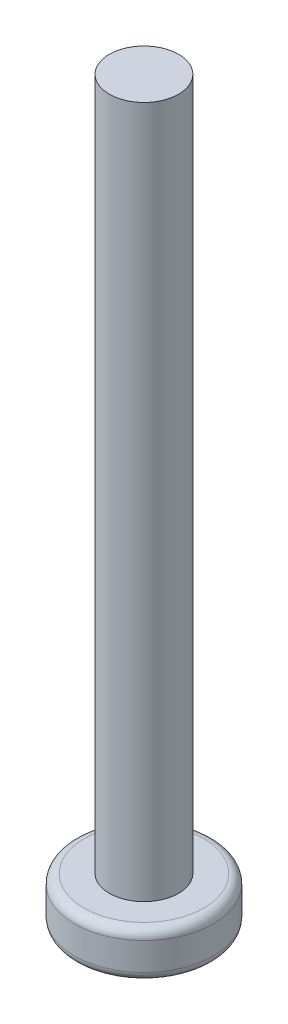
ISO-10303-21;
HEADER;
FILE_DESCRIPTION(('STEP AP214'),'2;1');
FILE_NAME('part.step','',(''),(''),'','','');
FILE_SCHEMA(('AUTOMOTIVE_DESIGN { 1 0 10303 214 1 1 1 1 }'));
ENDSEC;
DATA;
#1=APPLICATION_CONTEXT('core data for automotive mechanical design processes');
#2=APPLICATION_PROTOCOL_DEFINITION('international standard','automotive_design',2000,#1);
#3=PRODUCT_CONTEXT('',#1,'mechanical');
#4=PRODUCT('Part','Part','',(#3));
#5=PRODUCT_RELATED_PRODUCT_CATEGORY('part','',(#4));
#6=PRODUCT_DEFINITION_FORMATION('','',#4);
#7=PRODUCT_DEFINITION_CONTEXT('part definition',#1,'design');
#8=PRODUCT_DEFINITION('design','',#6,#7);
#9=PRODUCT_DEFINITION_SHAPE('','',#8);
#10=(LENGTH_UNIT() NAMED_UNIT(*) SI_UNIT(.MILLI.,.METRE.));
#11=(NAMED_UNIT(*) PLANE_ANGLE_UNIT() SI_UNIT($,.RADIAN.));
#12=(NAMED_UNIT(*) SI_UNIT($,.STERADIAN.) SOLID_ANGLE_UNIT());
#13=UNCERTAINTY_MEASURE_WITH_UNIT(LENGTH_MEASURE(1.E-05),#10,'distance_accuracy_value','');
#14=(GEOMETRIC_REPRESENTATION_CONTEXT(3) GLOBAL_UNCERTAINTY_ASSIGNED_CONTEXT((#13)) GLOBAL_UNIT_ASSIGNED_CONTEXT((#10,
#11,#12)) REPRESENTATION_CONTEXT('',''));
#15=CARTESIAN_POINT('',(0.,0.,0.));
#16=DIRECTION('',(0.,0.,1.));
#17=DIRECTION('',(1.,0.,0.));
#18=AXIS2_PLACEMENT_3D('',#15,#16,#17);
#19=CARTESIAN_POINT('',(0.,2.,0.));
#20=DIRECTION('',(0.,1.,0.));
#21=DIRECTION('',(0.,0.,1.));
#22=AXIS2_PLACEMENT_3D('',#19,#20,#21);
#23=PLANE('',#22);
#24=CARTESIAN_POINT('',(0.,2.,0.));
#25=DIRECTION('',(0.,1.,0.));
#26=DIRECTION('',(0.,0.,1.));
#27=AXIS2_PLACEMENT_3D('',#24,#25,#26);
#28=CIRCLE('',#27,2.6);
#29=CARTESIAN_POINT('',(0.,2.,2.6));
#30=VERTEX_POINT('',#29);
#31=EDGE_CURVE('E215',#30,#30,#28,.T.);
#32=ORIENTED_EDGE('',*,*,#31,.T.);
#33=EDGE_LOOP('',(#32));
#34=FACE_BOUND('',#33,.T.);
#35=CARTESIAN_POINT('',(0.,2.,0.));
#36=DIRECTION('',(0.,1.,0.));
#37=DIRECTION('',(0.,0.,1.));
#38=AXIS2_PLACEMENT_3D('',#35,#36,#37);
#39=CIRCLE('',#38,1.5);
#40=CARTESIAN_POINT('',(0.,2.,1.5));
#41=VERTEX_POINT('',#40);
#42=EDGE_CURVE('E194',#41,#41,#39,.T.);
#43=ORIENTED_EDGE('',*,*,#42,.F.);
#44=EDGE_LOOP('',(#43));
#45=FACE_BOUND('',#44,.T.);
#46=ADVANCED_FACE('F35',(#34,#45),#23,.T.);
#47=CARTESIAN_POINT('',(0.,2.,0.));
#48=DIRECTION('',(0.,-1.,0.));
#49=DIRECTION('',(0.,0.,-1.));
#50=AXIS2_PLACEMENT_3D('',#47,#48,#49);
#51=CYLINDRICAL_SURFACE('',#50,3.);
#52=CARTESIAN_POINT('',(0.,1.6,0.));
#53=DIRECTION('',(0.,1.,0.));
#54=DIRECTION('',(0.,0.,1.));
#55=AXIS2_PLACEMENT_3D('',#52,#53,#54);
#56=CIRCLE('',#55,3.);
#57=CARTESIAN_POINT('',(0.,1.6,3.));
#58=VERTEX_POINT('',#57);
#59=EDGE_CURVE('E43',#58,#58,#56,.F.);
#60=ORIENTED_EDGE('',*,*,#59,.T.);
#61=EDGE_LOOP('',(#60));
#62=FACE_BOUND('',#61,.T.);
#63=CARTESIAN_POINT('',(0.,0.4,0.));
#64=DIRECTION('',(0.,1.,0.));
#65=DIRECTION('',(0.,0.,1.));
#66=AXIS2_PLACEMENT_3D('',#63,#64,#65);
#67=CIRCLE('',#66,3.);
#68=CARTESIAN_POINT('',(0.,0.4,3.));
#69=VERTEX_POINT('',#68);
#70=EDGE_CURVE('E220',#69,#69,#67,.T.);
#71=ORIENTED_EDGE('',*,*,#70,.T.);
#72=EDGE_LOOP('',(#71));
#73=FACE_BOUND('',#72,.T.);
#74=ADVANCED_FACE('F225',(#62,#73),#51,.T.);
#75=CARTESIAN_POINT('',(0.,0.,0.));
#76=DIRECTION('',(0.,1.,0.));
#77=DIRECTION('',(0.,0.,1.));
#78=AXIS2_PLACEMENT_3D('',#75,#76,#77);
#79=PLANE('',#78);
#80=CARTESIAN_POINT('',(0.,0.,0.));
#81=DIRECTION('',(0.,1.,0.));
#82=DIRECTION('',(0.,0.,1.));
#83=AXIS2_PLACEMENT_3D('',#80,#81,#82);
#84=CIRCLE('',#83,2.6);
#85=CARTESIAN_POINT('',(0.,0.,2.6));
#86=VERTEX_POINT('',#85);
#87=EDGE_CURVE('E11',#86,#86,#84,.F.);
#88=ORIENTED_EDGE('',*,*,#87,.T.);
#89=EDGE_LOOP('',(#88));
#90=FACE_BOUND('',#89,.T.);
#91=DIRECTION('',(1.,0.,0.));
#92=VECTOR('',#91,1.);
#93=CARTESIAN_POINT('',(0.,0.,0.45));
#94=LINE('',#93,#92);
#95=CARTESIAN_POINT('',(-1.5,0.,0.45));
#96=VERTEX_POINT('',#95);
#97=CARTESIAN_POINT('',(-0.45,0.,0.45));
#98=VERTEX_POINT('',#97);
#99=EDGE_CURVE('E162',#96,#98,#94,.T.);
#100=ORIENTED_EDGE('',*,*,#99,.T.);
#101=DIRECTION('',(0.,0.,-1.));
#102=VECTOR('',#101,1.);
#103=CARTESIAN_POINT('',(-0.45,0.,0.));
#104=LINE('',#103,#102);
#105=CARTESIAN_POINT('',(-0.45,0.,1.5));
#106=VERTEX_POINT('',#105);
#107=EDGE_CURVE('E50',#106,#98,#104,.T.);
#108=ORIENTED_EDGE('',*,*,#107,.F.);
#109=DIRECTION('',(1.,0.,0.));
#110=VECTOR('',#109,1.);
#111=CARTESIAN_POINT('',(0.,0.,1.5));
#112=LINE('',#111,#110);
#113=CARTESIAN_POINT('',(0.45,0.,1.5));
#114=VERTEX_POINT('',#113);
#115=EDGE_CURVE('E189',#106,#114,#112,.T.);
#116=ORIENTED_EDGE('',*,*,#115,.T.);
#117=DIRECTION('',(0.,0.,-1.));
#118=VECTOR('',#117,1.);
#119=CARTESIAN_POINT('',(0.45,0.,0.));
#120=LINE('',#119,#118);
#121=CARTESIAN_POINT('',(0.45,0.,0.45));
#122=VERTEX_POINT('',#121);
#123=EDGE_CURVE('E187',#114,#122,#120,.T.);
#124=ORIENTED_EDGE('',*,*,#123,.T.);
#125=DIRECTION('',(1.,0.,0.));
#126=VECTOR('',#125,1.);
#127=CARTESIAN_POINT('',(0.,0.,0.45));
#128=LINE('',#127,#126);
#129=CARTESIAN_POINT('',(1.5,0.,0.45));
#130=VERTEX_POINT('',#129);
#131=EDGE_CURVE('E145',#122,#130,#128,.T.);
#132=ORIENTED_EDGE('',*,*,#131,.T.);
#133=DIRECTION('',(0.,0.,-1.));
#134=VECTOR('',#133,1.);
#135=CARTESIAN_POINT('',(1.5,0.,0.));
#136=LINE('',#135,#134);
#137=CARTESIAN_POINT('',(1.5,0.,-0.45));
#138=VERTEX_POINT('',#137);
#139=EDGE_CURVE('E183',#130,#138,#136,.T.);
#140=ORIENTED_EDGE('',*,*,#139,.T.);
#141=DIRECTION('',(1.,0.,0.));
#142=VECTOR('',#141,1.);
#143=CARTESIAN_POINT('',(0.,0.,-0.45));
#144=LINE('',#143,#142);
#145=CARTESIAN_POINT('',(0.45,0.,-0.45));
#146=VERTEX_POINT('',#145);
#147=EDGE_CURVE('E180',#146,#138,#144,.T.);
#148=ORIENTED_EDGE('',*,*,#147,.F.);
#149=DIRECTION('',(0.,0.,-1.));
#150=VECTOR('',#149,1.);
#151=CARTESIAN_POINT('',(0.45,0.,0.));
#152=LINE('',#151,#150);
#153=CARTESIAN_POINT('',(0.45,0.,-1.5));
#154=VERTEX_POINT('',#153);
#155=EDGE_CURVE('E177',#146,#154,#152,.T.);
#156=ORIENTED_EDGE('',*,*,#155,.T.);
#157=DIRECTION('',(1.,0.,0.));
#158=VECTOR('',#157,1.);
#159=CARTESIAN_POINT('',(0.,0.,-1.5));
#160=LINE('',#159,#158);
#161=CARTESIAN_POINT('',(-0.45,0.,-1.5));
#162=VERTEX_POINT('',#161);
#163=EDGE_CURVE('E174',#162,#154,#160,.T.);
#164=ORIENTED_EDGE('',*,*,#163,.F.);
#165=DIRECTION('',(0.,0.,-1.));
#166=VECTOR('',#165,1.);
#167=CARTESIAN_POINT('',(-0.45,0.,0.));
#168=LINE('',#167,#166);
#169=CARTESIAN_POINT('',(-0.45,0.,-0.45));
#170=VERTEX_POINT('',#169);
#171=EDGE_CURVE('E171',#170,#162,#168,.T.);
#172=ORIENTED_EDGE('',*,*,#171,.F.);
#173=DIRECTION('',(1.,0.,0.));
#174=VECTOR('',#173,1.);
#175=CARTESIAN_POINT('',(0.,0.,-0.45));
#176=LINE('',#175,#174);
#177=CARTESIAN_POINT('',(-1.5,0.,-0.45));
#178=VERTEX_POINT('',#177);
#179=EDGE_CURVE('E168',#178,#170,#176,.T.);
#180=ORIENTED_EDGE('',*,*,#179,.F.);
#181=DIRECTION('',(0.,0.,-1.));
#182=VECTOR('',#181,1.);
#183=CARTESIAN_POINT('',(-1.5,0.,0.));
#184=LINE('',#183,#182);
#185=EDGE_CURVE('E165',#96,#178,#184,.T.);
#186=ORIENTED_EDGE('',*,*,#185,.F.);
#187=EDGE_LOOP('',(#100,#108,#116,#124,#132,#140,#148,#156,#164,#172,#180,#186));
#188=FACE_BOUND('',#187,.T.);
#189=ADVANCED_FACE('F241',(#90,#188),#79,.F.);
#190=CARTESIAN_POINT('',(0.,32.,0.));
#191=DIRECTION('',(0.,-1.,0.));
#192=DIRECTION('',(0.,0.,-1.));
#193=AXIS2_PLACEMENT_3D('',#190,#191,#192);
#194=CYLINDRICAL_SURFACE('',#193,1.5);
#195=CARTESIAN_POINT('',(0.,32.,0.));
#196=DIRECTION('',(0.,1.,0.));
#197=DIRECTION('',(0.,0.,1.));
#198=AXIS2_PLACEMENT_3D('',#195,#196,#197);
#199=CIRCLE('',#198,1.5);
#200=CARTESIAN_POINT('',(0.,32.,1.5));
#201=VERTEX_POINT('',#200);
#202=EDGE_CURVE('E212',#201,#201,#199,.T.);
#203=ORIENTED_EDGE('',*,*,#202,.F.);
#204=EDGE_LOOP('',(#203));
#205=FACE_BOUND('',#204,.T.);
#206=ORIENTED_EDGE('',*,*,#42,.T.);
#207=EDGE_LOOP('',(#206));
#208=FACE_BOUND('',#207,.T.);
#209=ADVANCED_FACE('F238',(#205,#208),#194,.T.);
#210=CARTESIAN_POINT('',(0.,32.,0.));
#211=DIRECTION('',(0.,1.,0.));
#212=DIRECTION('',(0.,0.,1.));
#213=AXIS2_PLACEMENT_3D('',#210,#211,#212);
#214=PLANE('',#213);
#215=ORIENTED_EDGE('',*,*,#202,.T.);
#216=EDGE_LOOP('',(#215));
#217=FACE_BOUND('',#216,.T.);
#218=ADVANCED_FACE('F240',(#217),#214,.T.);
#219=CARTESIAN_POINT('',(-0.45,1.9,0.));
#220=DIRECTION('',(-1.,0.,0.));
#221=DIRECTION('',(0.,0.,1.));
#222=AXIS2_PLACEMENT_3D('',#219,#220,#221);
#223=PLANE('',#222);
#224=ORIENTED_EDGE('',*,*,#107,.T.);
#225=DIRECTION('',(0.,-1.,0.));
#226=VECTOR('',#225,1.);
#227=CARTESIAN_POINT('',(-0.45,1.9,0.45));
#228=LINE('',#227,#226);
#229=CARTESIAN_POINT('',(-0.45,1.9,0.45));
#230=VERTEX_POINT('',#229);
#231=EDGE_CURVE('E160',#230,#98,#228,.T.);
#232=ORIENTED_EDGE('',*,*,#231,.F.);
#233=DIRECTION('',(0.,0.,-1.));
#234=VECTOR('',#233,1.);
#235=CARTESIAN_POINT('',(-0.45,1.9,0.));
#236=LINE('',#235,#234);
#237=CARTESIAN_POINT('',(-0.45,1.9,1.5));
#238=VERTEX_POINT('',#237);
#239=EDGE_CURVE('E192',#238,#230,#236,.T.);
#240=ORIENTED_EDGE('',*,*,#239,.F.);
#241=DIRECTION('',(0.,-1.,0.));
#242=VECTOR('',#241,1.);
#243=CARTESIAN_POINT('',(-0.45,1.9,1.5));
#244=LINE('',#243,#242);
#245=EDGE_CURVE('E58',#238,#106,#244,.T.);
#246=ORIENTED_EDGE('',*,*,#245,.T.);
#247=EDGE_LOOP('',(#224,#232,#240,#246));
#248=FACE_BOUND('',#247,.T.);
#249=ADVANCED_FACE('F248',(#248),#223,.F.);
#250=CARTESIAN_POINT('',(0.,1.9,1.5));
#251=DIRECTION('',(0.,0.,-1.));
#252=DIRECTION('',(-1.,0.,0.));
#253=AXIS2_PLACEMENT_3D('',#250,#251,#252);
#254=PLANE('',#253);
#255=ORIENTED_EDGE('',*,*,#115,.F.);
#256=ORIENTED_EDGE('',*,*,#245,.F.);
#257=DIRECTION('',(1.,0.,0.));
#258=VECTOR('',#257,1.);
#259=CARTESIAN_POINT('',(0.,1.9,1.5));
#260=LINE('',#259,#258);
#261=CARTESIAN_POINT('',(0.45,1.9,1.5));
#262=VERTEX_POINT('',#261);
#263=EDGE_CURVE('E138',#238,#262,#260,.T.);
#264=ORIENTED_EDGE('',*,*,#263,.T.);
#265=DIRECTION('',(0.,-1.,0.));
#266=VECTOR('',#265,1.);
#267=CARTESIAN_POINT('',(0.45,1.9,1.5));
#268=LINE('',#267,#266);
#269=EDGE_CURVE('E135',#262,#114,#268,.T.);
#270=ORIENTED_EDGE('',*,*,#269,.T.);
#271=EDGE_LOOP('',(#255,#256,#264,#270));
#272=FACE_BOUND('',#271,.T.);
#273=ADVANCED_FACE('F321',(#272),#254,.T.);
#274=CARTESIAN_POINT('',(0.45,1.9,0.));
#275=DIRECTION('',(-1.,0.,0.));
#276=DIRECTION('',(0.,0.,1.));
#277=AXIS2_PLACEMENT_3D('',#274,#275,#276);
#278=PLANE('',#277);
#279=ORIENTED_EDGE('',*,*,#123,.F.);
#280=ORIENTED_EDGE('',*,*,#269,.F.);
#281=DIRECTION('',(0.,0.,-1.));
#282=VECTOR('',#281,1.);
#283=CARTESIAN_POINT('',(0.45,1.9,0.));
#284=LINE('',#283,#282);
#285=CARTESIAN_POINT('',(0.45,1.9,0.45));
#286=VERTEX_POINT('',#285);
#287=EDGE_CURVE('E129',#262,#286,#284,.T.);
#288=ORIENTED_EDGE('',*,*,#287,.T.);
#289=DIRECTION('',(0.,-1.,0.));
#290=VECTOR('',#289,1.);
#291=CARTESIAN_POINT('',(0.45,1.9,0.45));
#292=LINE('',#291,#290);
#293=EDGE_CURVE('E133',#286,#122,#292,.T.);
#294=ORIENTED_EDGE('',*,*,#293,.T.);
#295=EDGE_LOOP('',(#279,#280,#288,#294));
#296=FACE_BOUND('',#295,.T.);
#297=ADVANCED_FACE('F132',(#296),#278,.T.);
#298=CARTESIAN_POINT('',(0.,1.9,0.45));
#299=DIRECTION('',(0.,0.,-1.));
#300=DIRECTION('',(-1.,0.,0.));
#301=AXIS2_PLACEMENT_3D('',#298,#299,#300);
#302=PLANE('',#301);
#303=ORIENTED_EDGE('',*,*,#131,.F.);
#304=ORIENTED_EDGE('',*,*,#293,.F.);
#305=DIRECTION('',(1.,0.,0.));
#306=VECTOR('',#305,1.);
#307=CARTESIAN_POINT('',(0.,1.9,0.45));
#308=LINE('',#307,#306);
#309=CARTESIAN_POINT('',(1.5,1.9,0.45));
#310=VERTEX_POINT('',#309);
#311=EDGE_CURVE('E139',#286,#310,#308,.T.);
#312=ORIENTED_EDGE('',*,*,#311,.T.);
#313=DIRECTION('',(0.,-1.,0.));
#314=VECTOR('',#313,1.);
#315=CARTESIAN_POINT('',(1.5,1.9,0.45));
#316=LINE('',#315,#314);
#317=EDGE_CURVE('E147',#310,#130,#316,.T.);
#318=ORIENTED_EDGE('',*,*,#317,.T.);
#319=EDGE_LOOP('',(#303,#304,#312,#318));
#320=FACE_BOUND('',#319,.T.);
#321=ADVANCED_FACE('F142',(#320),#302,.T.);
#322=CARTESIAN_POINT('',(1.5,1.9,0.));
#323=DIRECTION('',(-1.,0.,0.));
#324=DIRECTION('',(0.,0.,1.));
#325=AXIS2_PLACEMENT_3D('',#322,#323,#324);
#326=PLANE('',#325);
#327=ORIENTED_EDGE('',*,*,#139,.F.);
#328=ORIENTED_EDGE('',*,*,#317,.F.);
#329=DIRECTION('',(0.,0.,-1.));
#330=VECTOR('',#329,1.);
#331=CARTESIAN_POINT('',(1.5,1.9,0.));
#332=LINE('',#331,#330);
#333=CARTESIAN_POINT('',(1.5,1.9,-0.45));
#334=VERTEX_POINT('',#333);
#335=EDGE_CURVE('E153',#310,#334,#332,.T.);
#336=ORIENTED_EDGE('',*,*,#335,.T.);
#337=DIRECTION('',(0.,-1.,0.));
#338=VECTOR('',#337,1.);
#339=CARTESIAN_POINT('',(1.5,1.9,-0.45));
#340=LINE('',#339,#338);
#341=EDGE_CURVE('E197',#334,#138,#340,.T.);
#342=ORIENTED_EDGE('',*,*,#341,.T.);
#343=EDGE_LOOP('',(#327,#328,#336,#342));
#344=FACE_BOUND('',#343,.T.);
#345=ADVANCED_FACE('F320',(#344),#326,.T.);
#346=CARTESIAN_POINT('',(0.,1.9,-0.45));
#347=DIRECTION('',(0.,0.,-1.));
#348=DIRECTION('',(-1.,0.,0.));
#349=AXIS2_PLACEMENT_3D('',#346,#347,#348);
#350=PLANE('',#349);
#351=ORIENTED_EDGE('',*,*,#147,.T.);
#352=ORIENTED_EDGE('',*,*,#341,.F.);
#353=DIRECTION('',(1.,0.,0.));
#354=VECTOR('',#353,1.);
#355=CARTESIAN_POINT('',(0.,1.9,-0.45));
#356=LINE('',#355,#354);
#357=CARTESIAN_POINT('',(0.45,1.9,-0.45));
#358=VERTEX_POINT('',#357);
#359=EDGE_CURVE('E155',#358,#334,#356,.T.);
#360=ORIENTED_EDGE('',*,*,#359,.F.);
#361=DIRECTION('',(0.,-1.,0.));
#362=VECTOR('',#361,1.);
#363=CARTESIAN_POINT('',(0.45,1.9,-0.45));
#364=LINE('',#363,#362);
#365=EDGE_CURVE('E199',#358,#146,#364,.T.);
#366=ORIENTED_EDGE('',*,*,#365,.T.);
#367=EDGE_LOOP('',(#351,#352,#360,#366));
#368=FACE_BOUND('',#367,.T.);
#369=ADVANCED_FACE('F315',(#368),#350,.F.);
#370=CARTESIAN_POINT('',(0.45,1.9,0.));
#371=DIRECTION('',(-1.,0.,0.));
#372=DIRECTION('',(0.,0.,1.));
#373=AXIS2_PLACEMENT_3D('',#370,#371,#372);
#374=PLANE('',#373);
#375=ORIENTED_EDGE('',*,*,#155,.F.);
#376=ORIENTED_EDGE('',*,*,#365,.F.);
#377=DIRECTION('',(0.,0.,-1.));
#378=VECTOR('',#377,1.);
#379=CARTESIAN_POINT('',(0.45,1.9,0.));
#380=LINE('',#379,#378);
#381=CARTESIAN_POINT('',(0.45,1.9,-1.5));
#382=VERTEX_POINT('',#381);
#383=EDGE_CURVE('E310',#358,#382,#380,.T.);
#384=ORIENTED_EDGE('',*,*,#383,.T.);
#385=DIRECTION('',(0.,-1.,0.));
#386=VECTOR('',#385,1.);
#387=CARTESIAN_POINT('',(0.45,1.9,-1.5));
#388=LINE('',#387,#386);
#389=EDGE_CURVE('E201',#382,#154,#388,.T.);
#390=ORIENTED_EDGE('',*,*,#389,.T.);
#391=EDGE_LOOP('',(#375,#376,#384,#390));
#392=FACE_BOUND('',#391,.T.);
#393=ADVANCED_FACE('F337',(#392),#374,.T.);
#394=CARTESIAN_POINT('',(0.,1.9,-1.5));
#395=DIRECTION('',(0.,0.,-1.));
#396=DIRECTION('',(-1.,0.,0.));
#397=AXIS2_PLACEMENT_3D('',#394,#395,#396);
#398=PLANE('',#397);
#399=ORIENTED_EDGE('',*,*,#163,.T.);
#400=ORIENTED_EDGE('',*,*,#389,.F.);
#401=DIRECTION('',(1.,0.,0.));
#402=VECTOR('',#401,1.);
#403=CARTESIAN_POINT('',(0.,1.9,-1.5));
#404=LINE('',#403,#402);
#405=CARTESIAN_POINT('',(-0.45,1.9,-1.5));
#406=VERTEX_POINT('',#405);
#407=EDGE_CURVE('E307',#406,#382,#404,.T.);
#408=ORIENTED_EDGE('',*,*,#407,.F.);
#409=DIRECTION('',(0.,-1.,0.));
#410=VECTOR('',#409,1.);
#411=CARTESIAN_POINT('',(-0.45,1.9,-1.5));
#412=LINE('',#411,#410);
#413=EDGE_CURVE('E203',#406,#162,#412,.T.);
#414=ORIENTED_EDGE('',*,*,#413,.T.);
#415=EDGE_LOOP('',(#399,#400,#408,#414));
#416=FACE_BOUND('',#415,.T.);
#417=ADVANCED_FACE('F340',(#416),#398,.F.);
#418=CARTESIAN_POINT('',(-0.45,1.9,0.));
#419=DIRECTION('',(-1.,0.,0.));
#420=DIRECTION('',(0.,0.,1.));
#421=AXIS2_PLACEMENT_3D('',#418,#419,#420);
#422=PLANE('',#421);
#423=ORIENTED_EDGE('',*,*,#171,.T.);
#424=ORIENTED_EDGE('',*,*,#413,.F.);
#425=DIRECTION('',(0.,0.,-1.));
#426=VECTOR('',#425,1.);
#427=CARTESIAN_POINT('',(-0.45,1.9,0.));
#428=LINE('',#427,#426);
#429=CARTESIAN_POINT('',(-0.45,1.9,-0.45));
#430=VERTEX_POINT('',#429);
#431=EDGE_CURVE('E304',#430,#406,#428,.T.);
#432=ORIENTED_EDGE('',*,*,#431,.F.);
#433=DIRECTION('',(0.,-1.,0.));
#434=VECTOR('',#433,1.);
#435=CARTESIAN_POINT('',(-0.45,1.9,-0.45));
#436=LINE('',#435,#434);
#437=EDGE_CURVE('E205',#430,#170,#436,.T.);
#438=ORIENTED_EDGE('',*,*,#437,.T.);
#439=EDGE_LOOP('',(#423,#424,#432,#438));
#440=FACE_BOUND('',#439,.T.);
#441=ADVANCED_FACE('F344',(#440),#422,.F.);
#442=CARTESIAN_POINT('',(0.,1.9,-0.45));
#443=DIRECTION('',(0.,0.,-1.));
#444=DIRECTION('',(-1.,0.,0.));
#445=AXIS2_PLACEMENT_3D('',#442,#443,#444);
#446=PLANE('',#445);
#447=ORIENTED_EDGE('',*,*,#179,.T.);
#448=ORIENTED_EDGE('',*,*,#437,.F.);
#449=DIRECTION('',(1.,0.,0.));
#450=VECTOR('',#449,1.);
#451=CARTESIAN_POINT('',(0.,1.9,-0.45));
#452=LINE('',#451,#450);
#453=CARTESIAN_POINT('',(-1.5,1.9,-0.45));
#454=VERTEX_POINT('',#453);
#455=EDGE_CURVE('E301',#454,#430,#452,.T.);
#456=ORIENTED_EDGE('',*,*,#455,.F.);
#457=DIRECTION('',(0.,-1.,0.));
#458=VECTOR('',#457,1.);
#459=CARTESIAN_POINT('',(-1.5,1.9,-0.45));
#460=LINE('',#459,#458);
#461=EDGE_CURVE('E207',#454,#178,#460,.T.);
#462=ORIENTED_EDGE('',*,*,#461,.T.);
#463=EDGE_LOOP('',(#447,#448,#456,#462));
#464=FACE_BOUND('',#463,.T.);
#465=ADVANCED_FACE('F348',(#464),#446,.F.);
#466=CARTESIAN_POINT('',(-1.5,1.9,0.));
#467=DIRECTION('',(-1.,0.,0.));
#468=DIRECTION('',(0.,0.,1.));
#469=AXIS2_PLACEMENT_3D('',#466,#467,#468);
#470=PLANE('',#469);
#471=ORIENTED_EDGE('',*,*,#185,.T.);
#472=ORIENTED_EDGE('',*,*,#461,.F.);
#473=DIRECTION('',(0.,0.,-1.));
#474=VECTOR('',#473,1.);
#475=CARTESIAN_POINT('',(-1.5,1.9,0.));
#476=LINE('',#475,#474);
#477=CARTESIAN_POINT('',(-1.5,1.9,0.45));
#478=VERTEX_POINT('',#477);
#479=EDGE_CURVE('E297',#478,#454,#476,.T.);
#480=ORIENTED_EDGE('',*,*,#479,.F.);
#481=DIRECTION('',(0.,-1.,0.));
#482=VECTOR('',#481,1.);
#483=CARTESIAN_POINT('',(-1.5,1.9,0.45));
#484=LINE('',#483,#482);
#485=EDGE_CURVE('E209',#478,#96,#484,.T.);
#486=ORIENTED_EDGE('',*,*,#485,.T.);
#487=EDGE_LOOP('',(#471,#472,#480,#486));
#488=FACE_BOUND('',#487,.T.);
#489=ADVANCED_FACE('F352',(#488),#470,.F.);
#490=CARTESIAN_POINT('',(0.,1.9,0.45));
#491=DIRECTION('',(0.,0.,-1.));
#492=DIRECTION('',(-1.,0.,0.));
#493=AXIS2_PLACEMENT_3D('',#490,#491,#492);
#494=PLANE('',#493);
#495=ORIENTED_EDGE('',*,*,#99,.F.);
#496=ORIENTED_EDGE('',*,*,#485,.F.);
#497=DIRECTION('',(1.,0.,0.));
#498=VECTOR('',#497,1.);
#499=CARTESIAN_POINT('',(0.,1.9,0.45));
#500=LINE('',#499,#498);
#501=EDGE_CURVE('E102',#478,#230,#500,.T.);
#502=ORIENTED_EDGE('',*,*,#501,.T.);
#503=ORIENTED_EDGE('',*,*,#231,.T.);
#504=EDGE_LOOP('',(#495,#496,#502,#503));
#505=FACE_BOUND('',#504,.T.);
#506=ADVANCED_FACE('F293',(#505),#494,.T.);
#507=CARTESIAN_POINT('',(0.,1.9,0.));
#508=DIRECTION('',(0.,-1.,0.));
#509=DIRECTION('',(0.,0.,-1.));
#510=AXIS2_PLACEMENT_3D('',#507,#508,#509);
#511=PLANE('',#510);
#512=ORIENTED_EDGE('',*,*,#239,.T.);
#513=ORIENTED_EDGE('',*,*,#501,.F.);
#514=ORIENTED_EDGE('',*,*,#479,.T.);
#515=ORIENTED_EDGE('',*,*,#455,.T.);
#516=ORIENTED_EDGE('',*,*,#431,.T.);
#517=ORIENTED_EDGE('',*,*,#407,.T.);
#518=ORIENTED_EDGE('',*,*,#383,.F.);
#519=ORIENTED_EDGE('',*,*,#359,.T.);
#520=ORIENTED_EDGE('',*,*,#335,.F.);
#521=ORIENTED_EDGE('',*,*,#311,.F.);
#522=ORIENTED_EDGE('',*,*,#287,.F.);
#523=ORIENTED_EDGE('',*,*,#263,.F.);
#524=EDGE_LOOP('',(#512,#513,#514,#515,#516,#517,#518,#519,#520,#521,#522,#523));
#525=FACE_BOUND('',#524,.T.);
#526=ADVANCED_FACE('F151',(#525),#511,.T.);
#527=CARTESIAN_POINT('',(0.,1.6,0.));
#528=DIRECTION('',(0.,1.,0.));
#529=DIRECTION('',(0.,0.,1.));
#530=AXIS2_PLACEMENT_3D('',#527,#528,#529);
#531=TOROIDAL_SURFACE('',#530,2.6,0.4);
#532=ORIENTED_EDGE('',*,*,#59,.F.);
#533=EDGE_LOOP('',(#532));
#534=FACE_BOUND('',#533,.T.);
#535=ORIENTED_EDGE('',*,*,#31,.F.);
#536=EDGE_LOOP('',(#535));
#537=FACE_BOUND('',#536,.T.);
#538=ADVANCED_FACE('F228',(#534,#537),#531,.T.);
#539=CARTESIAN_POINT('',(0.,0.4,0.));
#540=DIRECTION('',(0.,1.,0.));
#541=DIRECTION('',(0.,0.,1.));
#542=AXIS2_PLACEMENT_3D('',#539,#540,#541);
#543=TOROIDAL_SURFACE('',#542,2.6,0.4);
#544=ORIENTED_EDGE('',*,*,#87,.F.);
#545=EDGE_LOOP('',(#544));
#546=FACE_BOUND('',#545,.T.);
#547=ORIENTED_EDGE('',*,*,#70,.F.);
#548=EDGE_LOOP('',(#547));
#549=FACE_BOUND('',#548,.T.);
#550=ADVANCED_FACE('F37',(#546,#549),#543,.T.);
#551=CLOSED_SHELL('',(#46,#74,#189,#209,#218,#249,#273,#297,#321,#345,#369,#393,#417,#441,#465,
#489,#506,#526,#538,#550));
#552=MANIFOLD_SOLID_BREP('B2',#551);
#553=ADVANCED_BREP_SHAPE_REPRESENTATION('',(#18,#552),#14);
#554=SHAPE_DEFINITION_REPRESENTATION(#9,#553);
ENDSEC;
END-ISO-10303-21;
